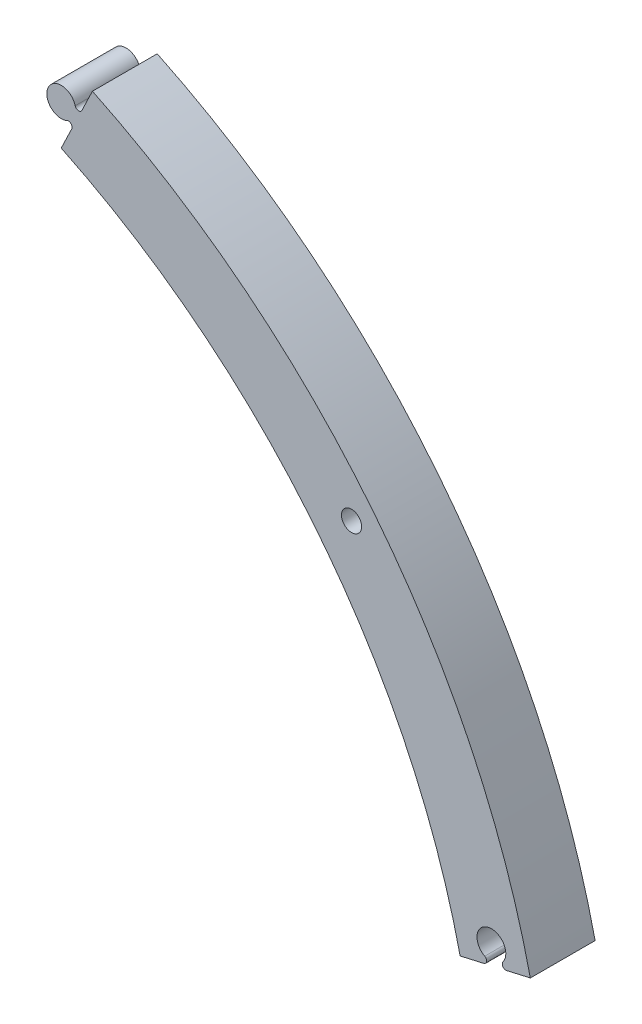
ISO-10303-21;
HEADER;
FILE_DESCRIPTION(('STEP AP214'),'2;1');
FILE_NAME('part.step','',(''),(''),'','','');
FILE_SCHEMA(('AUTOMOTIVE_DESIGN { 1 0 10303 214 1 1 1 1 }'));
ENDSEC;
DATA;
#1=APPLICATION_CONTEXT('core data for automotive mechanical design processes');
#2=APPLICATION_PROTOCOL_DEFINITION('international standard','automotive_design',2000,#1);
#3=PRODUCT_CONTEXT('',#1,'mechanical');
#4=PRODUCT('Part','Part','',(#3));
#5=PRODUCT_RELATED_PRODUCT_CATEGORY('part','',(#4));
#6=PRODUCT_DEFINITION_FORMATION('','',#4);
#7=PRODUCT_DEFINITION_CONTEXT('part definition',#1,'design');
#8=PRODUCT_DEFINITION('design','',#6,#7);
#9=PRODUCT_DEFINITION_SHAPE('','',#8);
#10=(LENGTH_UNIT() NAMED_UNIT(*) SI_UNIT(.MILLI.,.METRE.));
#11=(NAMED_UNIT(*) PLANE_ANGLE_UNIT() SI_UNIT($,.RADIAN.));
#12=(NAMED_UNIT(*) SI_UNIT($,.STERADIAN.) SOLID_ANGLE_UNIT());
#13=UNCERTAINTY_MEASURE_WITH_UNIT(LENGTH_MEASURE(1.E-05),#10,'distance_accuracy_value','');
#14=(GEOMETRIC_REPRESENTATION_CONTEXT(3) GLOBAL_UNCERTAINTY_ASSIGNED_CONTEXT((#13)) GLOBAL_UNIT_ASSIGNED_CONTEXT((#10,
#11,#12)) REPRESENTATION_CONTEXT('',''));
#15=CARTESIAN_POINT('',(0.,0.,0.));
#16=DIRECTION('',(0.,0.,1.));
#17=DIRECTION('',(1.,0.,0.));
#18=AXIS2_PLACEMENT_3D('',#15,#16,#17);
#19=CARTESIAN_POINT('',(107.633176528409,85.8345940422896,-3.81));
#20=DIRECTION('',(0.,0.,1.));
#21=DIRECTION('',(1.,0.,0.));
#22=AXIS2_PLACEMENT_3D('',#19,#20,#21);
#23=CYLINDRICAL_SURFACE('',#22,1.778);
#24=CARTESIAN_POINT('',(107.633176528409,85.8345940422896,11.43));
#25=DIRECTION('',(0.,0.,-1.));
#26=DIRECTION('',(-1.,0.,0.));
#27=AXIS2_PLACEMENT_3D('',#24,#25,#26);
#28=CIRCLE('',#27,1.778);
#29=CARTESIAN_POINT('',(109.411176528409,85.8345940422896,11.43));
#30=VERTEX_POINT('',#29);
#31=EDGE_CURVE('E142',#30,#30,#28,.T.);
#32=CARTESIAN_POINT('',(107.633176528409,85.8345940422896,3.175));
#33=DIRECTION('',(0.,0.,-1.));
#34=DIRECTION('',(-1.,0.,0.));
#35=AXIS2_PLACEMENT_3D('',#32,#33,#34);
#36=CIRCLE('',#35,1.778);
#37=CARTESIAN_POINT('',(109.411176528409,85.8345940422896,3.175));
#38=VERTEX_POINT('',#37);
#39=EDGE_CURVE('E39',#38,#38,#36,.F.);
#40=CARTESIAN_POINT('',(109.411176528409,85.8345940422896,11.43));
#41=CARTESIAN_POINT('',(109.411176528409,85.8345940422896,11.3440104166667));
#42=CARTESIAN_POINT('',(109.411176528409,85.8345940422896,11.2580208333333));
#43=CARTESIAN_POINT('',(109.411176528409,85.8345940422896,11.0860416666667));
#44=CARTESIAN_POINT('',(109.411176528409,85.8345940422896,11.0000520833333));
#45=CARTESIAN_POINT('',(109.411176528409,85.8345940422896,10.8280729166667));
#46=CARTESIAN_POINT('',(109.411176528409,85.8345940422896,10.7420833333333));
#47=CARTESIAN_POINT('',(109.411176528409,85.8345940422896,10.5701041666667));
#48=CARTESIAN_POINT('',(109.411176528409,85.8345940422896,10.4841145833333));
#49=CARTESIAN_POINT('',(109.411176528409,85.8345940422896,10.3121354166667));
#50=CARTESIAN_POINT('',(109.411176528409,85.8345940422896,10.2261458333333));
#51=CARTESIAN_POINT('',(109.411176528409,85.8345940422896,10.0541666666667));
#52=CARTESIAN_POINT('',(109.411176528409,85.8345940422896,9.96817708333333));
#53=CARTESIAN_POINT('',(109.411176528409,85.8345940422896,9.79619791666667));
#54=CARTESIAN_POINT('',(109.411176528409,85.8345940422896,9.71020833333333));
#55=CARTESIAN_POINT('',(109.411176528409,85.8345940422896,9.53822916666667));
#56=CARTESIAN_POINT('',(109.411176528409,85.8345940422896,9.45223958333333));
#57=CARTESIAN_POINT('',(109.411176528409,85.8345940422896,9.28026041666667));
#58=CARTESIAN_POINT('',(109.411176528409,85.8345940422896,9.19427083333333));
#59=CARTESIAN_POINT('',(109.411176528409,85.8345940422896,9.02229166666667));
#60=CARTESIAN_POINT('',(109.411176528409,85.8345940422896,8.93630208333333));
#61=CARTESIAN_POINT('',(109.411176528409,85.8345940422896,8.76432291666667));
#62=CARTESIAN_POINT('',(109.411176528409,85.8345940422896,8.67833333333333));
#63=CARTESIAN_POINT('',(109.411176528409,85.8345940422896,8.50635416666667));
#64=CARTESIAN_POINT('',(109.411176528409,85.8345940422896,8.42036458333333));
#65=CARTESIAN_POINT('',(109.411176528409,85.8345940422896,8.24838541666667));
#66=CARTESIAN_POINT('',(109.411176528409,85.8345940422896,8.16239583333333));
#67=CARTESIAN_POINT('',(109.411176528409,85.8345940422896,7.99041666666667));
#68=CARTESIAN_POINT('',(109.411176528409,85.8345940422896,7.90442708333333));
#69=CARTESIAN_POINT('',(109.411176528409,85.8345940422896,7.73244791666667));
#70=CARTESIAN_POINT('',(109.411176528409,85.8345940422896,7.64645833333333));
#71=CARTESIAN_POINT('',(109.411176528409,85.8345940422896,7.47447916666667));
#72=CARTESIAN_POINT('',(109.411176528409,85.8345940422896,7.38848958333333));
#73=CARTESIAN_POINT('',(109.411176528409,85.8345940422896,7.21651041666667));
#74=CARTESIAN_POINT('',(109.411176528409,85.8345940422896,7.13052083333333));
#75=CARTESIAN_POINT('',(109.411176528409,85.8345940422896,6.95854166666667));
#76=CARTESIAN_POINT('',(109.411176528409,85.8345940422896,6.87255208333333));
#77=CARTESIAN_POINT('',(109.411176528409,85.8345940422896,6.70057291666667));
#78=CARTESIAN_POINT('',(109.411176528409,85.8345940422896,6.61458333333333));
#79=CARTESIAN_POINT('',(109.411176528409,85.8345940422896,6.44260416666667));
#80=CARTESIAN_POINT('',(109.411176528409,85.8345940422896,6.35661458333333));
#81=CARTESIAN_POINT('',(109.411176528409,85.8345940422896,6.18463541666667));
#82=CARTESIAN_POINT('',(109.411176528409,85.8345940422896,6.09864583333333));
#83=CARTESIAN_POINT('',(109.411176528409,85.8345940422896,5.92666666666667));
#84=CARTESIAN_POINT('',(109.411176528409,85.8345940422896,5.84067708333333));
#85=CARTESIAN_POINT('',(109.411176528409,85.8345940422896,5.66869791666667));
#86=CARTESIAN_POINT('',(109.411176528409,85.8345940422896,5.58270833333333));
#87=CARTESIAN_POINT('',(109.411176528409,85.8345940422896,5.41072916666667));
#88=CARTESIAN_POINT('',(109.411176528409,85.8345940422896,5.32473958333333));
#89=CARTESIAN_POINT('',(109.411176528409,85.8345940422896,5.15276041666666));
#90=CARTESIAN_POINT('',(109.411176528409,85.8345940422896,5.06677083333333));
#91=CARTESIAN_POINT('',(109.411176528409,85.8345940422896,4.89479166666667));
#92=CARTESIAN_POINT('',(109.411176528409,85.8345940422896,4.80880208333333));
#93=CARTESIAN_POINT('',(109.411176528409,85.8345940422896,4.63682291666667));
#94=CARTESIAN_POINT('',(109.411176528409,85.8345940422896,4.55083333333333));
#95=CARTESIAN_POINT('',(109.411176528409,85.8345940422896,4.37885416666667));
#96=CARTESIAN_POINT('',(109.411176528409,85.8345940422896,4.29286458333333));
#97=CARTESIAN_POINT('',(109.411176528409,85.8345940422896,4.12088541666667));
#98=CARTESIAN_POINT('',(109.411176528409,85.8345940422896,4.03489583333333));
#99=CARTESIAN_POINT('',(109.411176528409,85.8345940422896,3.86291666666667));
#100=CARTESIAN_POINT('',(109.411176528409,85.8345940422896,3.77692708333333));
#101=CARTESIAN_POINT('',(109.411176528409,85.8345940422896,3.60494791666667));
#102=CARTESIAN_POINT('',(109.411176528409,85.8345940422896,3.51895833333333));
#103=CARTESIAN_POINT('',(109.411176528409,85.8345940422896,3.34697916666667));
#104=CARTESIAN_POINT('',(109.411176528409,85.8345940422896,3.26098958333333));
#105=CARTESIAN_POINT('',(109.411176528409,85.8345940422896,3.175));
#106=B_SPLINE_CURVE_WITH_KNOTS('',3,(#40,#41,#42,#43,#44,#45,#46,#47,#48,#49,#50,#51,#52,#53,
#54,#55,#56,#57,#58,#59,#60,#61,#62,#63,#64,#65,#66,#67,#68,#69,#70,#71,#72,#73,#74,#75,#76,#77,
#78,#79,#80,#81,#82,#83,#84,#85,#86,#87,#88,#89,#90,#91,#92,#93,#94,#95,#96,#97,#98,#99,#100,
#101,#102,#103,#104,#105),.UNSPECIFIED.,.F.,.F.,(4,2,2,2,2,2,2,2,2,2,2,2,2,2,2,2,2,2,2,2,2,2,2,
2,2,2,2,2,2,2,2,2,4),(0.,0.25796875,0.515937500000001,0.773906249999999,1.031875,1.28984375,
1.5478125,1.80578125,2.06375,2.32171875,2.5796875,2.83765625,3.095625,3.35359375,3.6115625,
3.86953125,4.1275,4.38546875,4.6434375,4.90140625,5.159375,5.41734375,5.6753125,5.93328125,
6.19125,6.44921875,6.7071875,6.96515625,7.223125,7.48109375,7.7390625,7.99703125,8.255),.UNSPECIFIED.);
#107=EDGE_CURVE('BSEAM35',#30,#38,#106,.T.);
#108=ORIENTED_EDGE('',*,*,#31,.F.);
#109=ORIENTED_EDGE('',*,*,#39,.F.);
#110=ORIENTED_EDGE('',*,*,#107,.T.);
#111=ORIENTED_EDGE('',*,*,#107,.F.);
#112=EDGE_LOOP('',(#108,#110,#109,#111));
#113=FACE_BOUND('',#112,.T.);
#114=ADVANCED_FACE('F35',(#113),#23,.F.);
#115=CARTESIAN_POINT('',(56.4169481113018,117.173419638614,0.));
#116=DIRECTION('',(0.901001319809715,-0.433816345590104,0.));
#117=DIRECTION('',(0.433816345590104,0.901001319809715,0.));
#118=AXIS2_PLACEMENT_3D('',#115,#116,#117);
#119=PLANE('',#118);
#120=DIRECTION('',(0.,0.,1.));
#121=VECTOR('',#120,1.);
#122=CARTESIAN_POINT('',(58.2764993801572,121.035556610916,0.));
#123=LINE('',#122,#121);
#124=CARTESIAN_POINT('',(58.2764993801572,121.035556610916,0.));
#125=VERTEX_POINT('',#124);
#126=CARTESIAN_POINT('',(58.2764993801572,121.035556610916,11.43));
#127=VERTEX_POINT('',#126);
#128=EDGE_CURVE('E160',#125,#127,#123,.T.);
#129=ORIENTED_EDGE('',*,*,#128,.F.);
#130=DIRECTION('',(0.433816345590104,0.901001319809715,0.));
#131=VECTOR('',#130,1.);
#132=CARTESIAN_POINT('',(51.8245522217456,107.635386321888,0.));
#133=LINE('',#132,#131);
#134=CARTESIAN_POINT('',(57.5188416291006,119.46196299093,0.));
#135=VERTEX_POINT('',#134);
#136=EDGE_CURVE('E244',#135,#125,#133,.T.);
#137=ORIENTED_EDGE('',*,*,#136,.F.);
#138=DIRECTION('',(0.,0.,1.));
#139=VECTOR('',#138,1.);
#140=CARTESIAN_POINT('',(57.5188416291006,119.46196299093,0.));
#141=LINE('',#140,#139);
#142=CARTESIAN_POINT('',(57.5188416291006,119.46196299093,7.62));
#143=VERTEX_POINT('',#142);
#144=EDGE_CURVE('E52',#143,#135,#141,.F.);
#145=ORIENTED_EDGE('',*,*,#144,.F.);
#146=DIRECTION('',(0.433816345590104,0.901001319809715,0.));
#147=VECTOR('',#146,1.);
#148=CARTESIAN_POINT('',(50.8317447079191,105.573405741009,7.62));
#149=LINE('',#148,#147);
#150=CARTESIAN_POINT('',(56.4169481113018,117.173419638614,7.62));
#151=VERTEX_POINT('',#150);
#152=EDGE_CURVE('E60',#151,#143,#149,.T.);
#153=ORIENTED_EDGE('',*,*,#152,.F.);
#154=DIRECTION('',(0.,0.,1.));
#155=VECTOR('',#154,1.);
#156=CARTESIAN_POINT('',(56.4169481113018,117.173419638614,0.));
#157=LINE('',#156,#155);
#158=CARTESIAN_POINT('',(56.4169481113018,117.173419638614,11.43));
#159=VERTEX_POINT('',#158);
#160=EDGE_CURVE('E218',#159,#151,#157,.F.);
#161=ORIENTED_EDGE('',*,*,#160,.F.);
#162=DIRECTION('',(-0.433816345590104,-0.901001319809715,0.));
#163=VECTOR('',#162,1.);
#164=CARTESIAN_POINT('',(55.7957822770518,115.883308645404,11.43));
#165=LINE('',#164,#163);
#166=EDGE_CURVE('E199',#127,#159,#165,.T.);
#167=ORIENTED_EDGE('',*,*,#166,.F.);
#168=EDGE_LOOP('',(#129,#137,#145,#153,#161,#167));
#169=FACE_BOUND('',#168,.T.);
#170=ADVANCED_FACE('F240',(#169),#119,.F.);
#171=CARTESIAN_POINT('',(60.0668644314407,124.753999427895,0.));
#172=DIRECTION('',(0.901001319809716,-0.433816345590101,0.));
#173=DIRECTION('',(0.433816345590101,0.901001319809716,0.));
#174=AXIS2_PLACEMENT_3D('',#171,#172,#173);
#175=PLANE('',#174);
#176=DIRECTION('',(0.,0.,1.));
#177=VECTOR('',#176,1.);
#178=CARTESIAN_POINT('',(61.9264157002961,128.616136400197,0.));
#179=LINE('',#178,#177);
#180=CARTESIAN_POINT('',(61.9264157002961,128.616136400197,0.));
#181=VERTEX_POINT('',#180);
#182=CARTESIAN_POINT('',(61.9264157002961,128.616136400197,11.43));
#183=VERTEX_POINT('',#182);
#184=EDGE_CURVE('E216',#181,#183,#179,.T.);
#185=ORIENTED_EDGE('',*,*,#184,.F.);
#186=DIRECTION('',(0.433816345590101,0.901001319809716,0.));
#187=VECTOR('',#186,1.);
#188=CARTESIAN_POINT('',(51.8245522217457,107.635386321888,0.));
#189=LINE('',#188,#187);
#190=CARTESIAN_POINT('',(60.0668644314407,124.753999427895,0.));
#191=VERTEX_POINT('',#190);
#192=EDGE_CURVE('E259',#191,#181,#189,.T.);
#193=ORIENTED_EDGE('',*,*,#192,.F.);
#194=DIRECTION('',(0.,0.,1.));
#195=VECTOR('',#194,1.);
#196=CARTESIAN_POINT('',(60.0668644314406,124.753999427895,0.));
#197=LINE('',#196,#195);
#198=CARTESIAN_POINT('',(60.0668644314406,124.753999427895,11.43));
#199=VERTEX_POINT('',#198);
#200=EDGE_CURVE('E421',#191,#199,#197,.T.);
#201=ORIENTED_EDGE('',*,*,#200,.T.);
#202=DIRECTION('',(-0.433816345590101,-0.901001319809716,0.));
#203=VECTOR('',#202,1.);
#204=CARTESIAN_POINT('',(55.7957822770519,115.883308645404,11.43));
#205=LINE('',#204,#203);
#206=EDGE_CURVE('E248',#183,#199,#205,.T.);
#207=ORIENTED_EDGE('',*,*,#206,.F.);
#208=EDGE_LOOP('',(#185,#193,#201,#207));
#209=FACE_BOUND('',#208,.T.);
#210=ADVANCED_FACE('F304',(#209),#175,.F.);
#211=CARTESIAN_POINT('',(59.4947285933615,125.029472807345,0.));
#212=DIRECTION('',(0.,0.,1.));
#213=DIRECTION('',(1.,0.,0.));
#214=AXIS2_PLACEMENT_3D('',#211,#212,#213);
#215=CYLINDRICAL_SURFACE('',#214,0.634999999999994);
#216=ORIENTED_EDGE('',*,*,#200,.F.);
#217=CARTESIAN_POINT('',(59.4947285933615,125.029472807345,0.));
#218=DIRECTION('',(0.,0.,1.));
#219=DIRECTION('',(1.,0.,0.));
#220=AXIS2_PLACEMENT_3D('',#217,#218,#219);
#221=CIRCLE('',#220,0.634999999999994);
#222=CARTESIAN_POINT('',(58.880868851293,124.866988294029,0.));
#223=VERTEX_POINT('',#222);
#224=EDGE_CURVE('E256',#223,#191,#221,.T.);
#225=ORIENTED_EDGE('',*,*,#224,.F.);
#226=DIRECTION('',(0.,0.,1.));
#227=VECTOR('',#226,1.);
#228=CARTESIAN_POINT('',(58.880868851293,124.866988294029,0.));
#229=LINE('',#228,#227);
#230=CARTESIAN_POINT('',(58.880868851293,124.866988294029,11.43));
#231=VERTEX_POINT('',#230);
#232=EDGE_CURVE('E424',#223,#231,#229,.T.);
#233=ORIENTED_EDGE('',*,*,#232,.T.);
#234=CARTESIAN_POINT('',(59.4947285933615,125.029472807345,11.43));
#235=DIRECTION('',(0.,0.,-1.));
#236=DIRECTION('',(-1.,0.,0.));
#237=AXIS2_PLACEMENT_3D('',#234,#235,#236);
#238=CIRCLE('',#237,0.634999999999994);
#239=EDGE_CURVE('E423',#199,#231,#238,.T.);
#240=ORIENTED_EDGE('',*,*,#239,.F.);
#241=EDGE_LOOP('',(#216,#225,#233,#240));
#242=FACE_BOUND('',#241,.T.);
#243=ADVANCED_FACE('F412',(#242),#215,.F.);
#244=CARTESIAN_POINT('',(56.4254298830189,124.217050240764,0.));
#245=DIRECTION('',(0.,0.,1.));
#246=DIRECTION('',(1.,0.,0.));
#247=AXIS2_PLACEMENT_3D('',#244,#245,#246);
#248=CYLINDRICAL_SURFACE('',#247,2.54000000000001);
#249=ORIENTED_EDGE('',*,*,#232,.F.);
#250=CARTESIAN_POINT('',(56.4254298830189,124.217050240764,0.));
#251=DIRECTION('',(0.,0.,1.));
#252=DIRECTION('',(1.,0.,0.));
#253=AXIS2_PLACEMENT_3D('',#250,#251,#252);
#254=CIRCLE('',#253,2.54000000000001);
#255=CARTESIAN_POINT('',(57.4485768102662,121.892234040445,0.));
#256=VERTEX_POINT('',#255);
#257=EDGE_CURVE('E252',#256,#223,#254,.F.);
#258=ORIENTED_EDGE('',*,*,#257,.F.);
#259=DIRECTION('',(0.,0.,1.));
#260=VECTOR('',#259,1.);
#261=CARTESIAN_POINT('',(57.4485768102662,121.892234040445,0.));
#262=LINE('',#261,#260);
#263=CARTESIAN_POINT('',(57.4485768102662,121.892234040445,11.43));
#264=VERTEX_POINT('',#263);
#265=EDGE_CURVE('E165',#256,#264,#262,.T.);
#266=ORIENTED_EDGE('',*,*,#265,.T.);
#267=CARTESIAN_POINT('',(56.4254298830189,124.217050240764,11.43));
#268=DIRECTION('',(0.,0.,-1.));
#269=DIRECTION('',(-1.,0.,0.));
#270=AXIS2_PLACEMENT_3D('',#267,#268,#269);
#271=CIRCLE('',#270,2.54000000000001);
#272=EDGE_CURVE('E432',#231,#264,#271,.F.);
#273=ORIENTED_EDGE('',*,*,#272,.F.);
#274=EDGE_LOOP('',(#249,#258,#266,#273));
#275=FACE_BOUND('',#274,.T.);
#276=ADVANCED_FACE('F409',(#275),#248,.T.);
#277=CARTESIAN_POINT('',(57.704363542078,121.311029990366,0.));
#278=DIRECTION('',(0.,0.,1.));
#279=DIRECTION('',(1.,0.,0.));
#280=AXIS2_PLACEMENT_3D('',#277,#278,#279);
#281=CYLINDRICAL_SURFACE('',#280,0.634999999999997);
#282=ORIENTED_EDGE('',*,*,#265,.F.);
#283=CARTESIAN_POINT('',(57.704363542078,121.311029990366,0.));
#284=DIRECTION('',(0.,0.,1.));
#285=DIRECTION('',(1.,0.,0.));
#286=AXIS2_PLACEMENT_3D('',#283,#284,#285);
#287=CIRCLE('',#286,0.634999999999997);
#288=EDGE_CURVE('E247',#125,#256,#287,.T.);
#289=ORIENTED_EDGE('',*,*,#288,.F.);
#290=ORIENTED_EDGE('',*,*,#128,.T.);
#291=CARTESIAN_POINT('',(57.704363542078,121.311029990366,11.43));
#292=DIRECTION('',(0.,0.,-1.));
#293=DIRECTION('',(-1.,0.,0.));
#294=AXIS2_PLACEMENT_3D('',#291,#292,#293);
#295=CIRCLE('',#294,0.634999999999997);
#296=EDGE_CURVE('E236',#264,#127,#295,.T.);
#297=ORIENTED_EDGE('',*,*,#296,.F.);
#298=EDGE_LOOP('',(#282,#289,#290,#297));
#299=FACE_BOUND('',#298,.T.);
#300=ADVANCED_FACE('F313',(#299),#281,.F.);
#301=CARTESIAN_POINT('',(134.987681719162,30.8206807187439,0.));
#302=DIRECTION('',(0.222593857771045,-0.974911264927534,0.));
#303=DIRECTION('',(0.974911264927534,0.222593857771045,0.));
#304=AXIS2_PLACEMENT_3D('',#301,#302,#303);
#305=PLANE('',#304);
#306=DIRECTION('',(0.,0.,1.));
#307=VECTOR('',#306,1.);
#308=CARTESIAN_POINT('',(139.166633245876,31.7748280091012,0.));
#309=LINE('',#308,#307);
#310=CARTESIAN_POINT('',(139.166633245876,31.7748280091012,0.));
#311=VERTEX_POINT('',#310);
#312=CARTESIAN_POINT('',(139.166633245876,31.7748280091012,11.43));
#313=VERTEX_POINT('',#312);
#314=EDGE_CURVE('E172',#311,#313,#309,.T.);
#315=ORIENTED_EDGE('',*,*,#314,.T.);
#316=DIRECTION('',(-0.974911264927534,-0.222593857771045,0.));
#317=VECTOR('',#316,1.);
#318=CARTESIAN_POINT('',(30.9776377672076,7.07288154655736,11.43));
#319=LINE('',#318,#317);
#320=CARTESIAN_POINT('',(134.987681719162,30.8206807187439,11.43));
#321=VERTEX_POINT('',#320);
#322=EDGE_CURVE('E153',#313,#321,#319,.T.);
#323=ORIENTED_EDGE('',*,*,#322,.T.);
#324=DIRECTION('',(0.,0.,1.));
#325=VECTOR('',#324,1.);
#326=CARTESIAN_POINT('',(134.987681719162,30.8206807187439,0.));
#327=LINE('',#326,#325);
#328=CARTESIAN_POINT('',(134.987681719162,30.8206807187439,0.));
#329=VERTEX_POINT('',#328);
#330=EDGE_CURVE('E11',#329,#321,#327,.T.);
#331=ORIENTED_EDGE('',*,*,#330,.F.);
#332=DIRECTION('',(0.974911264927534,0.222593857771045,0.));
#333=VECTOR('',#332,1.);
#334=CARTESIAN_POINT('',(28.7728236912498,6.56947360730059,0.));
#335=LINE('',#334,#333);
#336=EDGE_CURVE('E175',#329,#311,#335,.T.);
#337=ORIENTED_EDGE('',*,*,#336,.T.);
#338=EDGE_LOOP('',(#315,#323,#331,#337));
#339=FACE_BOUND('',#338,.T.);
#340=ADVANCED_FACE('F277',(#339),#305,.T.);
#341=CARTESIAN_POINT('',(134.846334619477,31.4397493719729,0.));
#342=DIRECTION('',(0.,0.,1.));
#343=DIRECTION('',(1.,0.,0.));
#344=AXIS2_PLACEMENT_3D('',#341,#342,#343);
#345=CYLINDRICAL_SURFACE('',#344,0.634999999999999);
#346=ORIENTED_EDGE('',*,*,#330,.T.);
#347=CARTESIAN_POINT('',(134.846334619477,31.4397493719729,11.43));
#348=DIRECTION('',(0.,0.,-1.));
#349=DIRECTION('',(-1.,0.,0.));
#350=AXIS2_PLACEMENT_3D('',#347,#348,#349);
#351=CIRCLE('',#350,0.634999999999999);
#352=CARTESIAN_POINT('',(134.336563822602,31.8183768071292,11.43));
#353=VERTEX_POINT('',#352);
#354=EDGE_CURVE('E187',#321,#353,#351,.T.);
#355=ORIENTED_EDGE('',*,*,#354,.T.);
#356=DIRECTION('',(0.,0.,1.));
#357=VECTOR('',#356,1.);
#358=CARTESIAN_POINT('',(134.336563822602,31.8183768071292,0.));
#359=LINE('',#358,#357);
#360=CARTESIAN_POINT('',(134.336563822602,31.8183768071292,0.));
#361=VERTEX_POINT('',#360);
#362=EDGE_CURVE('E44',#361,#353,#359,.T.);
#363=ORIENTED_EDGE('',*,*,#362,.F.);
#364=CARTESIAN_POINT('',(134.846334619477,31.4397493719729,0.));
#365=DIRECTION('',(0.,0.,1.));
#366=DIRECTION('',(1.,0.,0.));
#367=AXIS2_PLACEMENT_3D('',#364,#365,#366);
#368=CIRCLE('',#367,0.634999999999999);
#369=EDGE_CURVE('E178',#361,#329,#368,.T.);
#370=ORIENTED_EDGE('',*,*,#369,.T.);
#371=EDGE_LOOP('',(#346,#355,#363,#370));
#372=FACE_BOUND('',#371,.T.);
#373=ADVANCED_FACE('F281',(#372),#345,.T.);
#374=CARTESIAN_POINT('',(132.2974806351,33.3328865477544,0.));
#375=DIRECTION('',(0.,0.,1.));
#376=DIRECTION('',(1.,0.,0.));
#377=AXIS2_PLACEMENT_3D('',#374,#375,#376);
#378=CYLINDRICAL_SURFACE('',#377,2.54000000000002);
#379=ORIENTED_EDGE('',*,*,#362,.T.);
#380=CARTESIAN_POINT('',(132.2974806351,33.3328865477544,11.43));
#381=DIRECTION('',(0.,0.,-1.));
#382=DIRECTION('',(-1.,0.,0.));
#383=AXIS2_PLACEMENT_3D('',#380,#381,#382);
#384=CIRCLE('',#383,2.54000000000002);
#385=CARTESIAN_POINT('',(131.117787813681,31.0834588767473,11.43));
#386=VERTEX_POINT('',#385);
#387=EDGE_CURVE('E190',#353,#386,#384,.F.);
#388=ORIENTED_EDGE('',*,*,#387,.T.);
#389=DIRECTION('',(0.,0.,1.));
#390=VECTOR('',#389,1.);
#391=CARTESIAN_POINT('',(131.117787813681,31.0834588767473,0.));
#392=LINE('',#391,#390);
#393=CARTESIAN_POINT('',(131.117787813681,31.0834588767473,0.));
#394=VERTEX_POINT('',#393);
#395=EDGE_CURVE('E202',#394,#386,#392,.T.);
#396=ORIENTED_EDGE('',*,*,#395,.F.);
#397=CARTESIAN_POINT('',(132.2974806351,33.3328865477544,0.));
#398=DIRECTION('',(0.,0.,1.));
#399=DIRECTION('',(1.,0.,0.));
#400=AXIS2_PLACEMENT_3D('',#397,#398,#399);
#401=CIRCLE('',#400,2.54000000000002);
#402=EDGE_CURVE('E181',#394,#361,#401,.F.);
#403=ORIENTED_EDGE('',*,*,#402,.T.);
#404=EDGE_LOOP('',(#379,#388,#396,#403));
#405=FACE_BOUND('',#404,.T.);
#406=ADVANCED_FACE('F283',(#405),#378,.F.);
#407=CARTESIAN_POINT('',(126.785260181297,28.9478860154091,0.));
#408=DIRECTION('',(0.222593857771042,-0.974911264927534,0.));
#409=DIRECTION('',(0.974911264927534,0.222593857771042,0.));
#410=AXIS2_PLACEMENT_3D('',#407,#408,#409);
#411=PLANE('',#410);
#412=DIRECTION('',(0.,0.,1.));
#413=VECTOR('',#412,1.);
#414=CARTESIAN_POINT('',(130.964211708011,29.9020333057666,0.));
#415=LINE('',#414,#413);
#416=CARTESIAN_POINT('',(130.964211708011,29.9020333057666,0.));
#417=VERTEX_POINT('',#416);
#418=CARTESIAN_POINT('',(130.964211708011,29.9020333057666,11.43));
#419=VERTEX_POINT('',#418);
#420=EDGE_CURVE('E200',#417,#419,#415,.T.);
#421=ORIENTED_EDGE('',*,*,#420,.T.);
#422=DIRECTION('',(-0.974911264927534,-0.222593857771042,0.));
#423=VECTOR('',#422,1.);
#424=CARTESIAN_POINT('',(30.9776377672071,7.07288154655755,11.43));
#425=LINE('',#424,#423);
#426=CARTESIAN_POINT('',(126.785260181296,28.947886015409,11.43));
#427=VERTEX_POINT('',#426);
#428=EDGE_CURVE('E196',#419,#427,#425,.T.);
#429=ORIENTED_EDGE('',*,*,#428,.T.);
#430=DIRECTION('',(0.,0.,1.));
#431=VECTOR('',#430,1.);
#432=CARTESIAN_POINT('',(126.785260181296,28.947886015409,0.));
#433=LINE('',#432,#431);
#434=CARTESIAN_POINT('',(126.785260181296,28.947886015409,7.62));
#435=VERTEX_POINT('',#434);
#436=EDGE_CURVE('E162',#427,#435,#433,.F.);
#437=ORIENTED_EDGE('',*,*,#436,.T.);
#438=DIRECTION('',(0.974911264927534,0.222593857771042,0.));
#439=VECTOR('',#438,1.);
#440=CARTESIAN_POINT('',(28.2216201722599,6.44362162248664,7.62));
#441=LINE('',#440,#439);
#442=CARTESIAN_POINT('',(129.261534794212,29.5132744141474,7.62));
#443=VERTEX_POINT('',#442);
#444=EDGE_CURVE('E159',#435,#443,#441,.T.);
#445=ORIENTED_EDGE('',*,*,#444,.T.);
#446=DIRECTION('',(0.,0.,1.));
#447=VECTOR('',#446,1.);
#448=CARTESIAN_POINT('',(129.261534794212,29.5132744141474,0.));
#449=LINE('',#448,#447);
#450=CARTESIAN_POINT('',(129.261534794212,29.5132744141474,0.));
#451=VERTEX_POINT('',#450);
#452=EDGE_CURVE('E140',#443,#451,#449,.F.);
#453=ORIENTED_EDGE('',*,*,#452,.T.);
#454=DIRECTION('',(0.974911264927534,0.222593857771042,0.));
#455=VECTOR('',#454,1.);
#456=CARTESIAN_POINT('',(28.7728236912493,6.56947360730084,0.));
#457=LINE('',#456,#455);
#458=EDGE_CURVE('E147',#451,#417,#457,.T.);
#459=ORIENTED_EDGE('',*,*,#458,.T.);
#460=EDGE_LOOP('',(#421,#429,#437,#445,#453,#459));
#461=FACE_BOUND('',#460,.T.);
#462=ADVANCED_FACE('F156',(#461),#411,.T.);
#463=CARTESIAN_POINT('',(130.822864608326,30.5211019589956,0.));
#464=DIRECTION('',(0.,0.,1.));
#465=DIRECTION('',(1.,0.,0.));
#466=AXIS2_PLACEMENT_3D('',#463,#464,#465);
#467=CYLINDRICAL_SURFACE('',#466,0.634999999999981);
#468=ORIENTED_EDGE('',*,*,#395,.T.);
#469=CARTESIAN_POINT('',(130.822864608326,30.5211019589956,11.43));
#470=DIRECTION('',(0.,0.,-1.));
#471=DIRECTION('',(-1.,0.,0.));
#472=AXIS2_PLACEMENT_3D('',#469,#470,#471);
#473=CIRCLE('',#472,0.634999999999981);
#474=EDGE_CURVE('E193',#386,#419,#473,.T.);
#475=ORIENTED_EDGE('',*,*,#474,.T.);
#476=ORIENTED_EDGE('',*,*,#420,.F.);
#477=CARTESIAN_POINT('',(130.822864608326,30.5211019589956,0.));
#478=DIRECTION('',(0.,0.,1.));
#479=DIRECTION('',(1.,0.,0.));
#480=AXIS2_PLACEMENT_3D('',#477,#478,#479);
#481=CIRCLE('',#480,0.634999999999981);
#482=EDGE_CURVE('E151',#417,#394,#481,.T.);
#483=ORIENTED_EDGE('',*,*,#482,.T.);
#484=EDGE_LOOP('',(#468,#475,#476,#483));
#485=FACE_BOUND('',#484,.T.);
#486=ADVANCED_FACE('F285',(#485),#467,.T.);
#487=CARTESIAN_POINT('',(0.,142.748,11.43));
#488=DIRECTION('',(0.,0.,-1.));
#489=DIRECTION('',(-1.,0.,0.));
#490=AXIS2_PLACEMENT_3D('',#487,#488,#489);
#491=PLANE('',#490);
#492=ORIENTED_EDGE('',*,*,#31,.T.);
#493=EDGE_LOOP('',(#492));
#494=FACE_BOUND('',#493,.T.);
#495=ORIENTED_EDGE('',*,*,#296,.T.);
#496=ORIENTED_EDGE('',*,*,#166,.T.);
#497=CARTESIAN_POINT('',(0.,0.,11.43));
#498=DIRECTION('',(0.,0.,1.));
#499=DIRECTION('',(1.,0.,0.));
#500=AXIS2_PLACEMENT_3D('',#497,#498,#499);
#501=CIRCLE('',#500,130.048);
#502=EDGE_CURVE('E205',#427,#159,#501,.T.);
#503=ORIENTED_EDGE('',*,*,#502,.F.);
#504=ORIENTED_EDGE('',*,*,#428,.F.);
#505=ORIENTED_EDGE('',*,*,#474,.F.);
#506=ORIENTED_EDGE('',*,*,#387,.F.);
#507=ORIENTED_EDGE('',*,*,#354,.F.);
#508=ORIENTED_EDGE('',*,*,#322,.F.);
#509=CARTESIAN_POINT('',(0.,0.,11.43));
#510=DIRECTION('',(0.,0.,1.));
#511=DIRECTION('',(1.,0.,0.));
#512=AXIS2_PLACEMENT_3D('',#509,#510,#511);
#513=CIRCLE('',#512,142.748);
#514=EDGE_CURVE('E209',#313,#183,#513,.T.);
#515=ORIENTED_EDGE('',*,*,#514,.T.);
#516=ORIENTED_EDGE('',*,*,#206,.T.);
#517=ORIENTED_EDGE('',*,*,#239,.T.);
#518=ORIENTED_EDGE('',*,*,#272,.T.);
#519=EDGE_LOOP('',(#495,#496,#503,#504,#505,#506,#507,#508,#515,#516,#517,#518));
#520=FACE_BOUND('',#519,.T.);
#521=ADVANCED_FACE('F233',(#494,#520),#491,.F.);
#522=CARTESIAN_POINT('',(0.,132.588,0.));
#523=DIRECTION('',(0.,0.,1.));
#524=DIRECTION('',(1.,0.,0.));
#525=AXIS2_PLACEMENT_3D('',#522,#523,#524);
#526=PLANE('',#525);
#527=CARTESIAN_POINT('',(107.633176528409,85.8345940422896,0.));
#528=DIRECTION('',(0.,0.,-1.));
#529=DIRECTION('',(-1.,0.,0.));
#530=AXIS2_PLACEMENT_3D('',#527,#528,#529);
#531=CIRCLE('',#530,3.96875);
#532=CARTESIAN_POINT('',(103.664426528409,85.8345940422896,0.));
#533=VERTEX_POINT('',#532);
#534=EDGE_CURVE('E437',#533,#533,#531,.T.);
#535=ORIENTED_EDGE('',*,*,#534,.F.);
#536=EDGE_LOOP('',(#535));
#537=FACE_BOUND('',#536,.T.);
#538=CARTESIAN_POINT('',(0.,0.,0.));
#539=DIRECTION('',(0.,0.,1.));
#540=DIRECTION('',(1.,0.,0.));
#541=AXIS2_PLACEMENT_3D('',#538,#539,#540);
#542=CIRCLE('',#541,132.588);
#543=EDGE_CURVE('E137',#451,#135,#542,.T.);
#544=ORIENTED_EDGE('',*,*,#543,.T.);
#545=ORIENTED_EDGE('',*,*,#136,.T.);
#546=ORIENTED_EDGE('',*,*,#288,.T.);
#547=ORIENTED_EDGE('',*,*,#257,.T.);
#548=ORIENTED_EDGE('',*,*,#224,.T.);
#549=ORIENTED_EDGE('',*,*,#192,.T.);
#550=CARTESIAN_POINT('',(0.,0.,0.));
#551=DIRECTION('',(0.,0.,1.));
#552=DIRECTION('',(1.,0.,0.));
#553=AXIS2_PLACEMENT_3D('',#550,#551,#552);
#554=CIRCLE('',#553,142.748);
#555=EDGE_CURVE('E168',#311,#181,#554,.T.);
#556=ORIENTED_EDGE('',*,*,#555,.F.);
#557=ORIENTED_EDGE('',*,*,#336,.F.);
#558=ORIENTED_EDGE('',*,*,#369,.F.);
#559=ORIENTED_EDGE('',*,*,#402,.F.);
#560=ORIENTED_EDGE('',*,*,#482,.F.);
#561=ORIENTED_EDGE('',*,*,#458,.F.);
#562=EDGE_LOOP('',(#544,#545,#546,#547,#548,#549,#556,#557,#558,#559,#560,#561));
#563=FACE_BOUND('',#562,.T.);
#564=ADVANCED_FACE('F148',(#537,#563),#526,.F.);
#565=CARTESIAN_POINT('',(0.,0.,0.));
#566=DIRECTION('',(0.,0.,1.));
#567=DIRECTION('',(1.,0.,0.));
#568=AXIS2_PLACEMENT_3D('',#565,#566,#567);
#569=CYLINDRICAL_SURFACE('',#568,142.748);
#570=ORIENTED_EDGE('',*,*,#555,.T.);
#571=ORIENTED_EDGE('',*,*,#184,.T.);
#572=ORIENTED_EDGE('',*,*,#514,.F.);
#573=ORIENTED_EDGE('',*,*,#314,.F.);
#574=EDGE_LOOP('',(#570,#571,#572,#573));
#575=FACE_BOUND('',#574,.T.);
#576=ADVANCED_FACE('F270',(#575),#569,.T.);
#577=CARTESIAN_POINT('',(0.,0.,0.));
#578=DIRECTION('',(0.,0.,1.));
#579=DIRECTION('',(1.,0.,0.));
#580=AXIS2_PLACEMENT_3D('',#577,#578,#579);
#581=CYLINDRICAL_SURFACE('',#580,130.048);
#582=ORIENTED_EDGE('',*,*,#502,.T.);
#583=ORIENTED_EDGE('',*,*,#160,.T.);
#584=CARTESIAN_POINT('',(0.,0.,7.62));
#585=DIRECTION('',(0.,0.,1.));
#586=DIRECTION('',(1.,0.,0.));
#587=AXIS2_PLACEMENT_3D('',#584,#585,#586);
#588=CIRCLE('',#587,130.048);
#589=EDGE_CURVE('E208',#435,#151,#588,.T.);
#590=ORIENTED_EDGE('',*,*,#589,.F.);
#591=ORIENTED_EDGE('',*,*,#436,.F.);
#592=EDGE_LOOP('',(#582,#583,#590,#591));
#593=FACE_BOUND('',#592,.T.);
#594=ADVANCED_FACE('F227',(#593),#581,.F.);
#595=CARTESIAN_POINT('',(0.,130.048,7.62));
#596=DIRECTION('',(0.,0.,1.));
#597=DIRECTION('',(1.,0.,0.));
#598=AXIS2_PLACEMENT_3D('',#595,#596,#597);
#599=PLANE('',#598);
#600=ORIENTED_EDGE('',*,*,#589,.T.);
#601=ORIENTED_EDGE('',*,*,#152,.T.);
#602=CARTESIAN_POINT('',(0.,0.,7.62));
#603=DIRECTION('',(0.,0.,1.));
#604=DIRECTION('',(1.,0.,0.));
#605=AXIS2_PLACEMENT_3D('',#602,#603,#604);
#606=CIRCLE('',#605,132.588);
#607=EDGE_CURVE('E143',#443,#143,#606,.T.);
#608=ORIENTED_EDGE('',*,*,#607,.F.);
#609=ORIENTED_EDGE('',*,*,#444,.F.);
#610=EDGE_LOOP('',(#600,#601,#608,#609));
#611=FACE_BOUND('',#610,.T.);
#612=ADVANCED_FACE('F224',(#611),#599,.F.);
#613=CARTESIAN_POINT('',(0.,0.,0.));
#614=DIRECTION('',(0.,0.,1.));
#615=DIRECTION('',(1.,0.,0.));
#616=AXIS2_PLACEMENT_3D('',#613,#614,#615);
#617=CYLINDRICAL_SURFACE('',#616,132.588);
#618=ORIENTED_EDGE('',*,*,#607,.T.);
#619=ORIENTED_EDGE('',*,*,#144,.T.);
#620=ORIENTED_EDGE('',*,*,#543,.F.);
#621=ORIENTED_EDGE('',*,*,#452,.F.);
#622=EDGE_LOOP('',(#618,#619,#620,#621));
#623=FACE_BOUND('',#622,.T.);
#624=ADVANCED_FACE('F37',(#623),#617,.F.);
#625=CARTESIAN_POINT('',(107.633176528409,85.8345940422896,3.175));
#626=DIRECTION('',(0.,0.,-1.));
#627=DIRECTION('',(-1.,0.,0.));
#628=AXIS2_PLACEMENT_3D('',#625,#626,#627);
#629=PLANE('',#628);
#630=CARTESIAN_POINT('',(107.633176528409,85.8345940422896,3.175));
#631=DIRECTION('',(0.,0.,-1.));
#632=DIRECTION('',(-1.,0.,0.));
#633=AXIS2_PLACEMENT_3D('',#630,#631,#632);
#634=CIRCLE('',#633,3.96875);
#635=CARTESIAN_POINT('',(103.664426528409,85.8345940422896,3.175));
#636=VERTEX_POINT('',#635);
#637=EDGE_CURVE('E427',#636,#636,#634,.T.);
#638=ORIENTED_EDGE('',*,*,#637,.T.);
#639=EDGE_LOOP('',(#638));
#640=FACE_BOUND('',#639,.T.);
#641=ORIENTED_EDGE('',*,*,#39,.T.);
#642=EDGE_LOOP('',(#641));
#643=FACE_BOUND('',#642,.T.);
#644=ADVANCED_FACE('F294',(#640,#643),#629,.T.);
#645=CARTESIAN_POINT('',(107.633176528409,85.8345940422896,3.175));
#646=DIRECTION('',(0.,0.,-1.));
#647=DIRECTION('',(-1.,0.,0.));
#648=AXIS2_PLACEMENT_3D('',#645,#646,#647);
#649=CYLINDRICAL_SURFACE('',#648,3.96875);
#650=ORIENTED_EDGE('',*,*,#637,.F.);
#651=EDGE_LOOP('',(#650));
#652=FACE_BOUND('',#651,.T.);
#653=ORIENTED_EDGE('',*,*,#534,.T.);
#654=EDGE_LOOP('',(#653));
#655=FACE_BOUND('',#654,.T.);
#656=ADVANCED_FACE('F391',(#652,#655),#649,.F.);
#657=CLOSED_SHELL('',(#114,#170,#210,#243,#276,#300,#340,#373,#406,#462,#486,#521,#564,#576,
#594,#612,#624,#644,#656));
#658=MANIFOLD_SOLID_BREP('B2',#657);
#659=ADVANCED_BREP_SHAPE_REPRESENTATION('',(#18,#658),#14);
#660=SHAPE_DEFINITION_REPRESENTATION(#9,#659);
ENDSEC;
END-ISO-10303-21;
